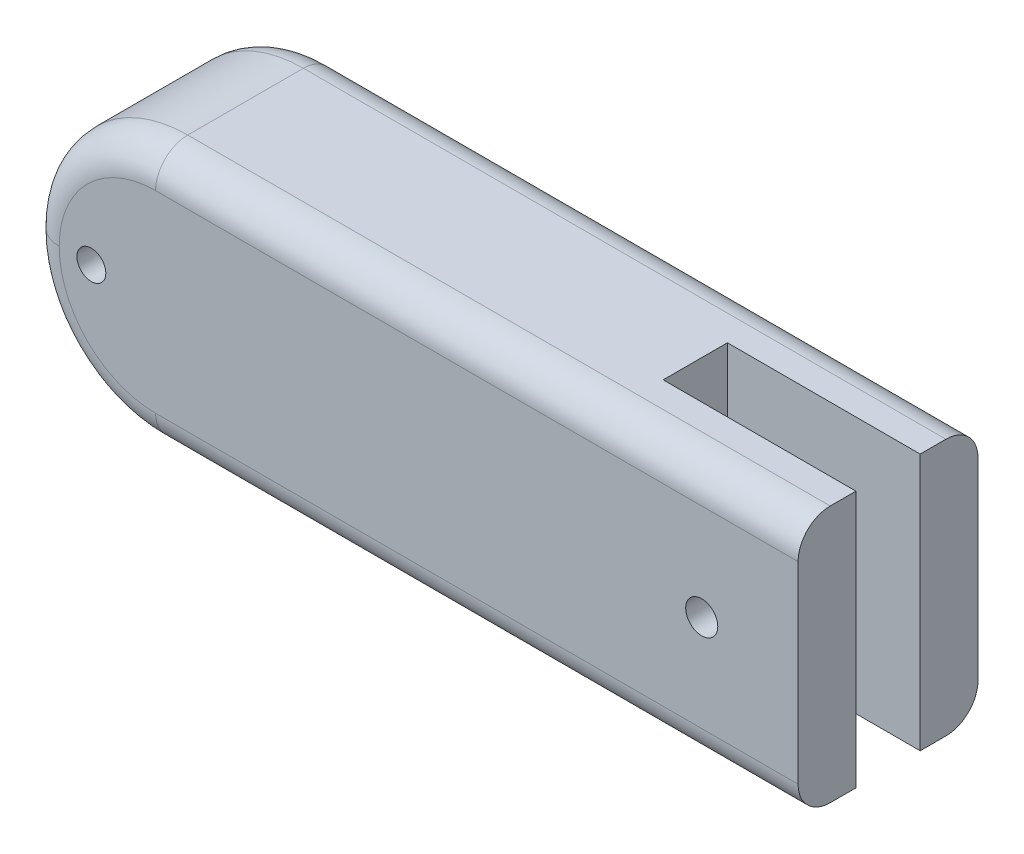
ISO-10303-21;
HEADER;
FILE_DESCRIPTION(('STEP AP214'),'2;1');
FILE_NAME('part.step','',(''),(''),'','','');
FILE_SCHEMA(('AUTOMOTIVE_DESIGN { 1 0 10303 214 1 1 1 1 }'));
ENDSEC;
DATA;
#1=APPLICATION_CONTEXT('core data for automotive mechanical design processes');
#2=APPLICATION_PROTOCOL_DEFINITION('international standard','automotive_design',2000,#1);
#3=PRODUCT_CONTEXT('',#1,'mechanical');
#4=PRODUCT('Part','Part','',(#3));
#5=PRODUCT_RELATED_PRODUCT_CATEGORY('part','',(#4));
#6=PRODUCT_DEFINITION_FORMATION('','',#4);
#7=PRODUCT_DEFINITION_CONTEXT('part definition',#1,'design');
#8=PRODUCT_DEFINITION('design','',#6,#7);
#9=PRODUCT_DEFINITION_SHAPE('','',#8);
#10=(LENGTH_UNIT() NAMED_UNIT(*) SI_UNIT(.MILLI.,.METRE.));
#11=(NAMED_UNIT(*) PLANE_ANGLE_UNIT() SI_UNIT($,.RADIAN.));
#12=(NAMED_UNIT(*) SI_UNIT($,.STERADIAN.) SOLID_ANGLE_UNIT());
#13=UNCERTAINTY_MEASURE_WITH_UNIT(LENGTH_MEASURE(1.E-05),#10,'distance_accuracy_value','');
#14=(GEOMETRIC_REPRESENTATION_CONTEXT(3) GLOBAL_UNCERTAINTY_ASSIGNED_CONTEXT((#13)) GLOBAL_UNIT_ASSIGNED_CONTEXT((#10,
#11,#12)) REPRESENTATION_CONTEXT('',''));
#15=CARTESIAN_POINT('',(0.,0.,0.));
#16=DIRECTION('',(0.,0.,1.));
#17=DIRECTION('',(1.,0.,0.));
#18=AXIS2_PLACEMENT_3D('',#15,#16,#17);
#19=CARTESIAN_POINT('',(120.,0.,28.));
#20=DIRECTION('',(-1.,0.,0.));
#21=DIRECTION('',(0.,0.,1.));
#22=AXIS2_PLACEMENT_3D('',#19,#20,#21);
#23=PLANE('',#22);
#24=DIRECTION('',(0.,0.,-1.));
#25=VECTOR('',#24,1.);
#26=CARTESIAN_POINT('',(120.,0.,28.));
#27=LINE('',#26,#25);
#28=CARTESIAN_POINT('',(120.,0.,9.));
#29=VERTEX_POINT('',#28);
#30=CARTESIAN_POINT('',(120.,0.,5.));
#31=VERTEX_POINT('',#30);
#32=EDGE_CURVE('E182',#29,#31,#27,.T.);
#33=ORIENTED_EDGE('',*,*,#32,.T.);
#34=CARTESIAN_POINT('',(120.,5.,5.));
#35=DIRECTION('',(-1.,0.,0.));
#36=DIRECTION('',(0.,0.,1.));
#37=AXIS2_PLACEMENT_3D('',#34,#35,#36);
#38=CIRCLE('',#37,5.);
#39=CARTESIAN_POINT('',(120.,5.,0.));
#40=VERTEX_POINT('',#39);
#41=EDGE_CURVE('E227',#31,#40,#38,.F.);
#42=ORIENTED_EDGE('',*,*,#41,.T.);
#43=DIRECTION('',(0.,1.,0.));
#44=VECTOR('',#43,1.);
#45=CARTESIAN_POINT('',(120.,0.,0.));
#46=LINE('',#45,#44);
#47=CARTESIAN_POINT('',(120.,35.,0.));
#48=VERTEX_POINT('',#47);
#49=EDGE_CURVE('E171',#40,#48,#46,.T.);
#50=ORIENTED_EDGE('',*,*,#49,.T.);
#51=CARTESIAN_POINT('',(120.,35.,5.));
#52=DIRECTION('',(-1.,0.,0.));
#53=DIRECTION('',(0.,0.,1.));
#54=AXIS2_PLACEMENT_3D('',#51,#52,#53);
#55=CIRCLE('',#54,5.);
#56=CARTESIAN_POINT('',(120.,40.,5.));
#57=VERTEX_POINT('',#56);
#58=EDGE_CURVE('E225',#48,#57,#55,.F.);
#59=ORIENTED_EDGE('',*,*,#58,.T.);
#60=DIRECTION('',(0.,0.,-1.));
#61=VECTOR('',#60,1.);
#62=CARTESIAN_POINT('',(120.,40.,28.));
#63=LINE('',#62,#61);
#64=CARTESIAN_POINT('',(120.,40.,9.));
#65=VERTEX_POINT('',#64);
#66=EDGE_CURVE('E178',#65,#57,#63,.T.);
#67=ORIENTED_EDGE('',*,*,#66,.F.);
#68=DIRECTION('',(0.,1.,0.));
#69=VECTOR('',#68,1.);
#70=CARTESIAN_POINT('',(120.,0.,9.));
#71=LINE('',#70,#69);
#72=EDGE_CURVE('E194',#29,#65,#71,.T.);
#73=ORIENTED_EDGE('',*,*,#72,.F.);
#74=EDGE_LOOP('',(#33,#42,#50,#59,#67,#73));
#75=FACE_BOUND('',#74,.T.);
#76=ADVANCED_FACE('F36',(#75),#23,.F.);
#77=CARTESIAN_POINT('',(0.,0.,28.));
#78=DIRECTION('',(0.,0.,-1.));
#79=DIRECTION('',(-1.,0.,0.));
#80=AXIS2_PLACEMENT_3D('',#77,#78,#79);
#81=PLANE('',#80);
#82=CARTESIAN_POINT('',(105.,20.,28.));
#83=DIRECTION('',(0.,0.,1.));
#84=DIRECTION('',(1.,0.,0.));
#85=AXIS2_PLACEMENT_3D('',#82,#83,#84);
#86=CIRCLE('',#85,2.50000000000001);
#87=CARTESIAN_POINT('',(107.5,20.,28.));
#88=VERTEX_POINT('',#87);
#89=EDGE_CURVE('E317',#88,#88,#86,.T.);
#90=ORIENTED_EDGE('',*,*,#89,.F.);
#91=EDGE_LOOP('',(#90));
#92=FACE_BOUND('',#91,.T.);
#93=DIRECTION('',(0.,1.,0.));
#94=VECTOR('',#93,1.);
#95=CARTESIAN_POINT('',(120.,0.,28.));
#96=LINE('',#95,#94);
#97=CARTESIAN_POINT('',(120.,5.,28.));
#98=VERTEX_POINT('',#97);
#99=CARTESIAN_POINT('',(120.,35.,28.));
#100=VERTEX_POINT('',#99);
#101=EDGE_CURVE('E175',#98,#100,#96,.T.);
#102=ORIENTED_EDGE('',*,*,#101,.T.);
#103=DIRECTION('',(-1.,0.,0.));
#104=VECTOR('',#103,1.);
#105=CARTESIAN_POINT('',(0.,35.,28.));
#106=LINE('',#105,#104);
#107=CARTESIAN_POINT('',(20.,35.,28.));
#108=VERTEX_POINT('',#107);
#109=EDGE_CURVE('E201',#100,#108,#106,.T.);
#110=ORIENTED_EDGE('',*,*,#109,.T.);
#111=CARTESIAN_POINT('',(20.,20.,28.));
#112=DIRECTION('',(0.,0.,-1.));
#113=DIRECTION('',(-1.,0.,0.));
#114=AXIS2_PLACEMENT_3D('',#111,#112,#113);
#115=CIRCLE('',#114,15.);
#116=CARTESIAN_POINT('',(5.,20.,28.));
#117=VERTEX_POINT('',#116);
#118=EDGE_CURVE('E199',#108,#117,#115,.F.);
#119=ORIENTED_EDGE('',*,*,#118,.T.);
#120=CARTESIAN_POINT('',(20.,20.,28.));
#121=DIRECTION('',(0.,0.,-1.));
#122=DIRECTION('',(-1.,0.,0.));
#123=AXIS2_PLACEMENT_3D('',#120,#121,#122);
#124=CIRCLE('',#123,15.);
#125=CARTESIAN_POINT('',(20.,5.,28.));
#126=VERTEX_POINT('',#125);
#127=EDGE_CURVE('E197',#117,#126,#124,.F.);
#128=ORIENTED_EDGE('',*,*,#127,.T.);
#129=DIRECTION('',(1.,0.,0.));
#130=VECTOR('',#129,1.);
#131=CARTESIAN_POINT('',(0.,5.,28.));
#132=LINE('',#131,#130);
#133=EDGE_CURVE('E190',#126,#98,#132,.T.);
#134=ORIENTED_EDGE('',*,*,#133,.T.);
#135=EDGE_LOOP('',(#102,#110,#119,#128,#134));
#136=FACE_BOUND('',#135,.T.);
#137=CARTESIAN_POINT('',(10.,20.,28.));
#138=DIRECTION('',(0.,0.,1.));
#139=DIRECTION('',(1.,0.,0.));
#140=AXIS2_PLACEMENT_3D('',#137,#138,#139);
#141=CIRCLE('',#140,2.25);
#142=CARTESIAN_POINT('',(12.25,20.,28.));
#143=VERTEX_POINT('',#142);
#144=EDGE_CURVE('E168',#143,#143,#141,.T.);
#145=ORIENTED_EDGE('',*,*,#144,.F.);
#146=EDGE_LOOP('',(#145));
#147=FACE_BOUND('',#146,.T.);
#148=ADVANCED_FACE('F337',(#92,#136,#147),#81,.F.);
#149=CARTESIAN_POINT('',(0.,0.,0.));
#150=DIRECTION('',(0.,0.,-1.));
#151=DIRECTION('',(-1.,0.,0.));
#152=AXIS2_PLACEMENT_3D('',#149,#150,#151);
#153=PLANE('',#152);
#154=CARTESIAN_POINT('',(105.,20.,0.));
#155=DIRECTION('',(0.,0.,-1.));
#156=DIRECTION('',(-1.,0.,0.));
#157=AXIS2_PLACEMENT_3D('',#154,#155,#156);
#158=CIRCLE('',#157,2.50000000000001);
#159=CARTESIAN_POINT('',(102.5,20.,0.));
#160=VERTEX_POINT('',#159);
#161=EDGE_CURVE('E246',#160,#160,#158,.T.);
#162=ORIENTED_EDGE('',*,*,#161,.F.);
#163=EDGE_LOOP('',(#162));
#164=FACE_BOUND('',#163,.T.);
#165=ORIENTED_EDGE('',*,*,#49,.F.);
#166=DIRECTION('',(1.,0.,0.));
#167=VECTOR('',#166,1.);
#168=CARTESIAN_POINT('',(20.,5.,0.));
#169=LINE('',#168,#167);
#170=CARTESIAN_POINT('',(20.,5.,0.));
#171=VERTEX_POINT('',#170);
#172=EDGE_CURVE('E11',#40,#171,#169,.F.);
#173=ORIENTED_EDGE('',*,*,#172,.T.);
#174=CARTESIAN_POINT('',(20.,20.,0.));
#175=DIRECTION('',(0.,0.,-1.));
#176=DIRECTION('',(-1.,0.,0.));
#177=AXIS2_PLACEMENT_3D('',#174,#175,#176);
#178=CIRCLE('',#177,15.);
#179=CARTESIAN_POINT('',(5.,20.,0.));
#180=VERTEX_POINT('',#179);
#181=EDGE_CURVE('E45',#171,#180,#178,.T.);
#182=ORIENTED_EDGE('',*,*,#181,.T.);
#183=CARTESIAN_POINT('',(20.,20.,0.));
#184=DIRECTION('',(0.,0.,-1.));
#185=DIRECTION('',(-1.,0.,0.));
#186=AXIS2_PLACEMENT_3D('',#183,#184,#185);
#187=CIRCLE('',#186,15.);
#188=CARTESIAN_POINT('',(20.,35.,0.));
#189=VERTEX_POINT('',#188);
#190=EDGE_CURVE('E231',#180,#189,#187,.T.);
#191=ORIENTED_EDGE('',*,*,#190,.T.);
#192=DIRECTION('',(-1.,0.,0.));
#193=VECTOR('',#192,1.);
#194=CARTESIAN_POINT('',(120.,35.,0.));
#195=LINE('',#194,#193);
#196=EDGE_CURVE('E229',#189,#48,#195,.F.);
#197=ORIENTED_EDGE('',*,*,#196,.T.);
#198=EDGE_LOOP('',(#165,#173,#182,#191,#197));
#199=FACE_BOUND('',#198,.T.);
#200=CARTESIAN_POINT('',(10.,20.,0.));
#201=DIRECTION('',(0.,0.,1.));
#202=DIRECTION('',(1.,0.,0.));
#203=AXIS2_PLACEMENT_3D('',#200,#201,#202);
#204=CIRCLE('',#203,2.25);
#205=CARTESIAN_POINT('',(12.25,20.,0.));
#206=VERTEX_POINT('',#205);
#207=EDGE_CURVE('E172',#206,#206,#204,.T.);
#208=ORIENTED_EDGE('',*,*,#207,.T.);
#209=EDGE_LOOP('',(#208));
#210=FACE_BOUND('',#209,.T.);
#211=ADVANCED_FACE('F258',(#164,#199,#210),#153,.T.);
#212=CARTESIAN_POINT('',(0.,0.,28.));
#213=DIRECTION('',(0.,1.,0.));
#214=DIRECTION('',(0.,0.,1.));
#215=AXIS2_PLACEMENT_3D('',#212,#213,#214);
#216=PLANE('',#215);
#217=DIRECTION('',(0.,0.,-1.));
#218=VECTOR('',#217,1.);
#219=CARTESIAN_POINT('',(20.,0.,28.));
#220=LINE('',#219,#218);
#221=CARTESIAN_POINT('',(20.,0.,23.));
#222=VERTEX_POINT('',#221);
#223=CARTESIAN_POINT('',(20.,0.,5.));
#224=VERTEX_POINT('',#223);
#225=EDGE_CURVE('E185',#222,#224,#220,.T.);
#226=ORIENTED_EDGE('',*,*,#225,.T.);
#227=DIRECTION('',(1.,0.,0.));
#228=VECTOR('',#227,1.);
#229=CARTESIAN_POINT('',(120.,0.,5.));
#230=LINE('',#229,#228);
#231=EDGE_CURVE('E222',#224,#31,#230,.T.);
#232=ORIENTED_EDGE('',*,*,#231,.T.);
#233=ORIENTED_EDGE('',*,*,#32,.F.);
#234=DIRECTION('',(1.,0.,0.));
#235=VECTOR('',#234,1.);
#236=CARTESIAN_POINT('',(90.,0.,9.));
#237=LINE('',#236,#235);
#238=CARTESIAN_POINT('',(90.,0.,9.));
#239=VERTEX_POINT('',#238);
#240=EDGE_CURVE('E163',#239,#29,#237,.T.);
#241=ORIENTED_EDGE('',*,*,#240,.F.);
#242=DIRECTION('',(0.,0.,-1.));
#243=VECTOR('',#242,1.);
#244=CARTESIAN_POINT('',(90.,0.,19.));
#245=LINE('',#244,#243);
#246=CARTESIAN_POINT('',(90.,0.,19.));
#247=VERTEX_POINT('',#246);
#248=EDGE_CURVE('E147',#247,#239,#245,.T.);
#249=ORIENTED_EDGE('',*,*,#248,.F.);
#250=DIRECTION('',(1.,0.,0.));
#251=VECTOR('',#250,1.);
#252=CARTESIAN_POINT('',(90.,0.,19.));
#253=LINE('',#252,#251);
#254=CARTESIAN_POINT('',(120.,0.,19.));
#255=VERTEX_POINT('',#254);
#256=EDGE_CURVE('E143',#247,#255,#253,.T.);
#257=ORIENTED_EDGE('',*,*,#256,.T.);
#258=CARTESIAN_POINT('',(120.,0.,23.));
#259=VERTEX_POINT('',#258);
#260=EDGE_CURVE('E183',#259,#255,#27,.T.);
#261=ORIENTED_EDGE('',*,*,#260,.F.);
#262=DIRECTION('',(1.,0.,0.));
#263=VECTOR('',#262,1.);
#264=CARTESIAN_POINT('',(0.,0.,23.));
#265=LINE('',#264,#263);
#266=EDGE_CURVE('E220',#259,#222,#265,.F.);
#267=ORIENTED_EDGE('',*,*,#266,.T.);
#268=EDGE_LOOP('',(#226,#232,#233,#241,#249,#257,#261,#267));
#269=FACE_BOUND('',#268,.T.);
#270=ADVANCED_FACE('F270',(#269),#216,.F.);
#271=CARTESIAN_POINT('',(120.,40.,23.));
#272=VERTEX_POINT('',#271);
#273=CARTESIAN_POINT('',(120.,40.,19.));
#274=VERTEX_POINT('',#273);
#275=EDGE_CURVE('E160',#272,#274,#63,.T.);
#276=ORIENTED_EDGE('',*,*,#275,.F.);
#277=CARTESIAN_POINT('',(120.,35.,23.));
#278=DIRECTION('',(-1.,0.,0.));
#279=DIRECTION('',(0.,0.,1.));
#280=AXIS2_PLACEMENT_3D('',#277,#278,#279);
#281=CIRCLE('',#280,5.);
#282=EDGE_CURVE('E210',#272,#100,#281,.F.);
#283=ORIENTED_EDGE('',*,*,#282,.T.);
#284=ORIENTED_EDGE('',*,*,#101,.F.);
#285=CARTESIAN_POINT('',(120.,5.,23.));
#286=DIRECTION('',(-1.,0.,0.));
#287=DIRECTION('',(0.,0.,1.));
#288=AXIS2_PLACEMENT_3D('',#285,#286,#287);
#289=CIRCLE('',#288,5.);
#290=EDGE_CURVE('E208',#98,#259,#289,.F.);
#291=ORIENTED_EDGE('',*,*,#290,.T.);
#292=ORIENTED_EDGE('',*,*,#260,.T.);
#293=DIRECTION('',(0.,-1.,0.));
#294=VECTOR('',#293,1.);
#295=CARTESIAN_POINT('',(120.,0.,19.));
#296=LINE('',#295,#294);
#297=EDGE_CURVE('E304',#274,#255,#296,.T.);
#298=ORIENTED_EDGE('',*,*,#297,.F.);
#299=EDGE_LOOP('',(#276,#283,#284,#291,#292,#298));
#300=FACE_BOUND('',#299,.T.);
#301=ADVANCED_FACE('F302',(#300),#23,.F.);
#302=CARTESIAN_POINT('',(0.,40.,28.));
#303=DIRECTION('',(0.,-1.,0.));
#304=DIRECTION('',(0.,0.,-1.));
#305=AXIS2_PLACEMENT_3D('',#302,#303,#304);
#306=PLANE('',#305);
#307=DIRECTION('',(0.,0.,-1.));
#308=VECTOR('',#307,1.);
#309=CARTESIAN_POINT('',(20.,40.,28.));
#310=LINE('',#309,#308);
#311=CARTESIAN_POINT('',(20.,40.,5.));
#312=VERTEX_POINT('',#311);
#313=CARTESIAN_POINT('',(20.,40.,23.));
#314=VERTEX_POINT('',#313);
#315=EDGE_CURVE('E188',#312,#314,#310,.F.);
#316=ORIENTED_EDGE('',*,*,#315,.T.);
#317=DIRECTION('',(-1.,0.,0.));
#318=VECTOR('',#317,1.);
#319=CARTESIAN_POINT('',(0.,40.,23.));
#320=LINE('',#319,#318);
#321=EDGE_CURVE('E206',#314,#272,#320,.F.);
#322=ORIENTED_EDGE('',*,*,#321,.T.);
#323=ORIENTED_EDGE('',*,*,#275,.T.);
#324=DIRECTION('',(1.,0.,0.));
#325=VECTOR('',#324,1.);
#326=CARTESIAN_POINT('',(90.,40.,19.));
#327=LINE('',#326,#325);
#328=CARTESIAN_POINT('',(90.,40.,19.));
#329=VERTEX_POINT('',#328);
#330=EDGE_CURVE('E140',#329,#274,#327,.T.);
#331=ORIENTED_EDGE('',*,*,#330,.F.);
#332=DIRECTION('',(0.,0.,1.));
#333=VECTOR('',#332,1.);
#334=CARTESIAN_POINT('',(90.,40.,19.));
#335=LINE('',#334,#333);
#336=CARTESIAN_POINT('',(90.,40.,9.));
#337=VERTEX_POINT('',#336);
#338=EDGE_CURVE('E148',#337,#329,#335,.T.);
#339=ORIENTED_EDGE('',*,*,#338,.F.);
#340=DIRECTION('',(1.,0.,0.));
#341=VECTOR('',#340,1.);
#342=CARTESIAN_POINT('',(90.,40.,9.));
#343=LINE('',#342,#341);
#344=EDGE_CURVE('E161',#337,#65,#343,.T.);
#345=ORIENTED_EDGE('',*,*,#344,.T.);
#346=ORIENTED_EDGE('',*,*,#66,.T.);
#347=DIRECTION('',(-1.,0.,0.));
#348=VECTOR('',#347,1.);
#349=CARTESIAN_POINT('',(20.,40.,5.));
#350=LINE('',#349,#348);
#351=EDGE_CURVE('E204',#57,#312,#350,.T.);
#352=ORIENTED_EDGE('',*,*,#351,.T.);
#353=EDGE_LOOP('',(#316,#322,#323,#331,#339,#345,#346,#352));
#354=FACE_BOUND('',#353,.T.);
#355=ADVANCED_FACE('F158',(#354),#306,.F.);
#356=CARTESIAN_POINT('',(10.,20.,28.));
#357=DIRECTION('',(0.,0.,-1.));
#358=DIRECTION('',(-1.,0.,0.));
#359=AXIS2_PLACEMENT_3D('',#356,#357,#358);
#360=CYLINDRICAL_SURFACE('',#359,2.25);
#361=ORIENTED_EDGE('',*,*,#144,.T.);
#362=EDGE_LOOP('',(#361));
#363=FACE_BOUND('',#362,.T.);
#364=ORIENTED_EDGE('',*,*,#207,.F.);
#365=EDGE_LOOP('',(#364));
#366=FACE_BOUND('',#365,.T.);
#367=ADVANCED_FACE('F351',(#363,#366),#360,.F.);
#368=CARTESIAN_POINT('',(90.,0.,9.));
#369=DIRECTION('',(0.,0.,-1.));
#370=DIRECTION('',(-1.,0.,0.));
#371=AXIS2_PLACEMENT_3D('',#368,#369,#370);
#372=PLANE('',#371);
#373=CARTESIAN_POINT('',(105.,20.,9.));
#374=DIRECTION('',(0.,0.,-1.));
#375=DIRECTION('',(-1.,0.,0.));
#376=AXIS2_PLACEMENT_3D('',#373,#374,#375);
#377=CIRCLE('',#376,2.50000000000001);
#378=CARTESIAN_POINT('',(102.5,20.,9.));
#379=VERTEX_POINT('',#378);
#380=EDGE_CURVE('E314',#379,#379,#377,.T.);
#381=ORIENTED_EDGE('',*,*,#380,.T.);
#382=EDGE_LOOP('',(#381));
#383=FACE_BOUND('',#382,.T.);
#384=ORIENTED_EDGE('',*,*,#72,.T.);
#385=ORIENTED_EDGE('',*,*,#344,.F.);
#386=DIRECTION('',(0.,1.,0.));
#387=VECTOR('',#386,1.);
#388=CARTESIAN_POINT('',(90.,0.,9.));
#389=LINE('',#388,#387);
#390=EDGE_CURVE('E152',#239,#337,#389,.T.);
#391=ORIENTED_EDGE('',*,*,#390,.F.);
#392=ORIENTED_EDGE('',*,*,#240,.T.);
#393=EDGE_LOOP('',(#384,#385,#391,#392));
#394=FACE_BOUND('',#393,.T.);
#395=ADVANCED_FACE('F310',(#383,#394),#372,.F.);
#396=CARTESIAN_POINT('',(90.,0.,19.));
#397=DIRECTION('',(0.,0.,1.));
#398=DIRECTION('',(1.,0.,0.));
#399=AXIS2_PLACEMENT_3D('',#396,#397,#398);
#400=PLANE('',#399);
#401=CARTESIAN_POINT('',(105.,20.,19.));
#402=DIRECTION('',(0.,0.,1.));
#403=DIRECTION('',(1.,0.,0.));
#404=AXIS2_PLACEMENT_3D('',#401,#402,#403);
#405=CIRCLE('',#404,2.50000000000001);
#406=CARTESIAN_POINT('',(107.5,20.,19.));
#407=VERTEX_POINT('',#406);
#408=EDGE_CURVE('E40',#407,#407,#405,.T.);
#409=ORIENTED_EDGE('',*,*,#408,.T.);
#410=EDGE_LOOP('',(#409));
#411=FACE_BOUND('',#410,.T.);
#412=ORIENTED_EDGE('',*,*,#297,.T.);
#413=ORIENTED_EDGE('',*,*,#256,.F.);
#414=DIRECTION('',(0.,-1.,0.));
#415=VECTOR('',#414,1.);
#416=CARTESIAN_POINT('',(90.,0.,19.));
#417=LINE('',#416,#415);
#418=EDGE_CURVE('E135',#329,#247,#417,.T.);
#419=ORIENTED_EDGE('',*,*,#418,.F.);
#420=ORIENTED_EDGE('',*,*,#330,.T.);
#421=EDGE_LOOP('',(#412,#413,#419,#420));
#422=FACE_BOUND('',#421,.T.);
#423=ADVANCED_FACE('F138',(#411,#422),#400,.F.);
#424=CARTESIAN_POINT('',(90.,0.,0.));
#425=DIRECTION('',(-1.,0.,0.));
#426=DIRECTION('',(0.,0.,1.));
#427=AXIS2_PLACEMENT_3D('',#424,#425,#426);
#428=PLANE('',#427);
#429=ORIENTED_EDGE('',*,*,#390,.T.);
#430=ORIENTED_EDGE('',*,*,#338,.T.);
#431=ORIENTED_EDGE('',*,*,#418,.T.);
#432=ORIENTED_EDGE('',*,*,#248,.T.);
#433=EDGE_LOOP('',(#429,#430,#431,#432));
#434=FACE_BOUND('',#433,.T.);
#435=ADVANCED_FACE('F151',(#434),#428,.F.);
#436=CARTESIAN_POINT('',(20.,20.,28.));
#437=DIRECTION('',(0.,0.,-1.));
#438=DIRECTION('',(-1.,0.,0.));
#439=AXIS2_PLACEMENT_3D('',#436,#437,#438);
#440=CYLINDRICAL_SURFACE('',#439,20.);
#441=DIRECTION('',(0.,0.,-1.));
#442=VECTOR('',#441,1.);
#443=CARTESIAN_POINT('',(0.,20.,28.));
#444=LINE('',#443,#442);
#445=CARTESIAN_POINT('',(0.,20.,23.));
#446=VERTEX_POINT('',#445);
#447=CARTESIAN_POINT('',(0.,20.,5.));
#448=VERTEX_POINT('',#447);
#449=EDGE_CURVE('E191',#446,#448,#444,.T.);
#450=ORIENTED_EDGE('',*,*,#449,.F.);
#451=CARTESIAN_POINT('',(20.,20.,23.));
#452=DIRECTION('',(0.,0.,-1.));
#453=DIRECTION('',(-1.,0.,0.));
#454=AXIS2_PLACEMENT_3D('',#451,#452,#453);
#455=CIRCLE('',#454,20.);
#456=EDGE_CURVE('E214',#446,#314,#455,.T.);
#457=ORIENTED_EDGE('',*,*,#456,.T.);
#458=ORIENTED_EDGE('',*,*,#315,.F.);
#459=CARTESIAN_POINT('',(20.,20.,5.));
#460=DIRECTION('',(0.,0.,-1.));
#461=DIRECTION('',(-1.,0.,0.));
#462=AXIS2_PLACEMENT_3D('',#459,#460,#461);
#463=CIRCLE('',#462,20.);
#464=EDGE_CURVE('E212',#312,#448,#463,.F.);
#465=ORIENTED_EDGE('',*,*,#464,.T.);
#466=EDGE_LOOP('',(#450,#457,#458,#465));
#467=FACE_BOUND('',#466,.T.);
#468=ADVANCED_FACE('F286',(#467),#440,.T.);
#469=CARTESIAN_POINT('',(20.,20.,28.));
#470=DIRECTION('',(0.,0.,-1.));
#471=DIRECTION('',(-1.,0.,0.));
#472=AXIS2_PLACEMENT_3D('',#469,#470,#471);
#473=CYLINDRICAL_SURFACE('',#472,20.);
#474=ORIENTED_EDGE('',*,*,#225,.F.);
#475=CARTESIAN_POINT('',(20.,20.,23.));
#476=DIRECTION('',(0.,0.,-1.));
#477=DIRECTION('',(-1.,0.,0.));
#478=AXIS2_PLACEMENT_3D('',#475,#476,#477);
#479=CIRCLE('',#478,20.);
#480=EDGE_CURVE('E218',#222,#446,#479,.T.);
#481=ORIENTED_EDGE('',*,*,#480,.T.);
#482=ORIENTED_EDGE('',*,*,#449,.T.);
#483=CARTESIAN_POINT('',(20.,20.,5.));
#484=DIRECTION('',(0.,0.,-1.));
#485=DIRECTION('',(-1.,0.,0.));
#486=AXIS2_PLACEMENT_3D('',#483,#484,#485);
#487=CIRCLE('',#486,20.);
#488=EDGE_CURVE('E216',#448,#224,#487,.F.);
#489=ORIENTED_EDGE('',*,*,#488,.T.);
#490=EDGE_LOOP('',(#474,#481,#482,#489));
#491=FACE_BOUND('',#490,.T.);
#492=ADVANCED_FACE('F281',(#491),#473,.T.);
#493=CARTESIAN_POINT('',(0.,5.,23.));
#494=DIRECTION('',(1.,0.,0.));
#495=DIRECTION('',(0.,0.,-1.));
#496=AXIS2_PLACEMENT_3D('',#493,#494,#495);
#497=CYLINDRICAL_SURFACE('',#496,5.);
#498=ORIENTED_EDGE('',*,*,#290,.F.);
#499=ORIENTED_EDGE('',*,*,#133,.F.);
#500=CARTESIAN_POINT('',(20.,5.,23.));
#501=DIRECTION('',(-1.,0.,0.));
#502=DIRECTION('',(0.,0.,1.));
#503=AXIS2_PLACEMENT_3D('',#500,#501,#502);
#504=CIRCLE('',#503,5.);
#505=EDGE_CURVE('E195',#222,#126,#504,.T.);
#506=ORIENTED_EDGE('',*,*,#505,.F.);
#507=ORIENTED_EDGE('',*,*,#266,.F.);
#508=EDGE_LOOP('',(#498,#499,#506,#507));
#509=FACE_BOUND('',#508,.T.);
#510=ADVANCED_FACE('F360',(#509),#497,.T.);
#511=CARTESIAN_POINT('',(20.,20.,23.));
#512=DIRECTION('',(0.,0.,-1.));
#513=DIRECTION('',(-1.,0.,0.));
#514=AXIS2_PLACEMENT_3D('',#511,#512,#513);
#515=TOROIDAL_SURFACE('',#514,15.,5.);
#516=ORIENTED_EDGE('',*,*,#505,.T.);
#517=ORIENTED_EDGE('',*,*,#127,.F.);
#518=CARTESIAN_POINT('',(5.,20.,23.));
#519=DIRECTION('',(0.,1.,0.));
#520=DIRECTION('',(0.,0.,1.));
#521=AXIS2_PLACEMENT_3D('',#518,#519,#520);
#522=CIRCLE('',#521,5.);
#523=EDGE_CURVE('E236',#446,#117,#522,.T.);
#524=ORIENTED_EDGE('',*,*,#523,.F.);
#525=ORIENTED_EDGE('',*,*,#480,.F.);
#526=EDGE_LOOP('',(#516,#517,#524,#525));
#527=FACE_BOUND('',#526,.T.);
#528=ADVANCED_FACE('F291',(#527),#515,.T.);
#529=CARTESIAN_POINT('',(20.,20.,23.));
#530=DIRECTION('',(0.,0.,-1.));
#531=DIRECTION('',(-1.,0.,0.));
#532=AXIS2_PLACEMENT_3D('',#529,#530,#531);
#533=TOROIDAL_SURFACE('',#532,15.,5.);
#534=ORIENTED_EDGE('',*,*,#523,.T.);
#535=ORIENTED_EDGE('',*,*,#118,.F.);
#536=CARTESIAN_POINT('',(20.,35.,23.));
#537=DIRECTION('',(1.,0.,0.));
#538=DIRECTION('',(0.,0.,-1.));
#539=AXIS2_PLACEMENT_3D('',#536,#537,#538);
#540=CIRCLE('',#539,5.);
#541=EDGE_CURVE('E234',#314,#108,#540,.T.);
#542=ORIENTED_EDGE('',*,*,#541,.F.);
#543=ORIENTED_EDGE('',*,*,#456,.F.);
#544=EDGE_LOOP('',(#534,#535,#542,#543));
#545=FACE_BOUND('',#544,.T.);
#546=ADVANCED_FACE('F295',(#545),#533,.T.);
#547=CARTESIAN_POINT('',(0.,35.,23.));
#548=DIRECTION('',(-1.,0.,0.));
#549=DIRECTION('',(0.,0.,1.));
#550=AXIS2_PLACEMENT_3D('',#547,#548,#549);
#551=CYLINDRICAL_SURFACE('',#550,5.);
#552=ORIENTED_EDGE('',*,*,#282,.F.);
#553=ORIENTED_EDGE('',*,*,#321,.F.);
#554=ORIENTED_EDGE('',*,*,#541,.T.);
#555=ORIENTED_EDGE('',*,*,#109,.F.);
#556=EDGE_LOOP('',(#552,#553,#554,#555));
#557=FACE_BOUND('',#556,.T.);
#558=ADVANCED_FACE('F300',(#557),#551,.T.);
#559=CARTESIAN_POINT('',(0.,35.,5.));
#560=DIRECTION('',(1.,0.,0.));
#561=DIRECTION('',(0.,0.,-1.));
#562=AXIS2_PLACEMENT_3D('',#559,#560,#561);
#563=CYLINDRICAL_SURFACE('',#562,5.);
#564=ORIENTED_EDGE('',*,*,#58,.F.);
#565=ORIENTED_EDGE('',*,*,#196,.F.);
#566=CARTESIAN_POINT('',(20.,35.,5.));
#567=DIRECTION('',(-1.,0.,0.));
#568=DIRECTION('',(0.,0.,1.));
#569=AXIS2_PLACEMENT_3D('',#566,#567,#568);
#570=CIRCLE('',#569,5.);
#571=EDGE_CURVE('E237',#312,#189,#570,.T.);
#572=ORIENTED_EDGE('',*,*,#571,.F.);
#573=ORIENTED_EDGE('',*,*,#351,.F.);
#574=EDGE_LOOP('',(#564,#565,#572,#573));
#575=FACE_BOUND('',#574,.T.);
#576=ADVANCED_FACE('F38',(#575),#563,.T.);
#577=CARTESIAN_POINT('',(20.,20.,5.));
#578=DIRECTION('',(0.,0.,-1.));
#579=DIRECTION('',(-1.,0.,0.));
#580=AXIS2_PLACEMENT_3D('',#577,#578,#579);
#581=TOROIDAL_SURFACE('',#580,15.,5.);
#582=ORIENTED_EDGE('',*,*,#571,.T.);
#583=ORIENTED_EDGE('',*,*,#190,.F.);
#584=CARTESIAN_POINT('',(5.,20.,5.));
#585=DIRECTION('',(0.,-1.,0.));
#586=DIRECTION('',(0.,0.,-1.));
#587=AXIS2_PLACEMENT_3D('',#584,#585,#586);
#588=CIRCLE('',#587,5.);
#589=EDGE_CURVE('E245',#448,#180,#588,.T.);
#590=ORIENTED_EDGE('',*,*,#589,.F.);
#591=ORIENTED_EDGE('',*,*,#464,.F.);
#592=EDGE_LOOP('',(#582,#583,#590,#591));
#593=FACE_BOUND('',#592,.T.);
#594=ADVANCED_FACE('F252',(#593),#581,.T.);
#595=CARTESIAN_POINT('',(20.,20.,5.));
#596=DIRECTION('',(0.,0.,-1.));
#597=DIRECTION('',(-1.,0.,0.));
#598=AXIS2_PLACEMENT_3D('',#595,#596,#597);
#599=TOROIDAL_SURFACE('',#598,15.,5.);
#600=ORIENTED_EDGE('',*,*,#589,.T.);
#601=ORIENTED_EDGE('',*,*,#181,.F.);
#602=CARTESIAN_POINT('',(20.,5.,5.));
#603=DIRECTION('',(1.,0.,0.));
#604=DIRECTION('',(0.,0.,-1.));
#605=AXIS2_PLACEMENT_3D('',#602,#603,#604);
#606=CIRCLE('',#605,5.);
#607=EDGE_CURVE('E242',#224,#171,#606,.T.);
#608=ORIENTED_EDGE('',*,*,#607,.F.);
#609=ORIENTED_EDGE('',*,*,#488,.F.);
#610=EDGE_LOOP('',(#600,#601,#608,#609));
#611=FACE_BOUND('',#610,.T.);
#612=ADVANCED_FACE('F280',(#611),#599,.T.);
#613=CARTESIAN_POINT('',(0.,5.,5.));
#614=DIRECTION('',(-1.,0.,0.));
#615=DIRECTION('',(0.,0.,1.));
#616=AXIS2_PLACEMENT_3D('',#613,#614,#615);
#617=CYLINDRICAL_SURFACE('',#616,5.);
#618=ORIENTED_EDGE('',*,*,#607,.T.);
#619=ORIENTED_EDGE('',*,*,#172,.F.);
#620=ORIENTED_EDGE('',*,*,#41,.F.);
#621=ORIENTED_EDGE('',*,*,#231,.F.);
#622=EDGE_LOOP('',(#618,#619,#620,#621));
#623=FACE_BOUND('',#622,.T.);
#624=ADVANCED_FACE('F268',(#623),#617,.T.);
#625=CARTESIAN_POINT('',(105.,20.,-12.));
#626=DIRECTION('',(0.,0.,1.));
#627=DIRECTION('',(1.,0.,0.));
#628=AXIS2_PLACEMENT_3D('',#625,#626,#627);
#629=CYLINDRICAL_SURFACE('',#628,2.50000000000001);
#630=ORIENTED_EDGE('',*,*,#89,.T.);
#631=EDGE_LOOP('',(#630));
#632=FACE_BOUND('',#631,.T.);
#633=ORIENTED_EDGE('',*,*,#408,.F.);
#634=EDGE_LOOP('',(#633));
#635=FACE_BOUND('',#634,.T.);
#636=ADVANCED_FACE('F325',(#632,#635),#629,.F.);
#637=ORIENTED_EDGE('',*,*,#161,.T.);
#638=EDGE_LOOP('',(#637));
#639=FACE_BOUND('',#638,.T.);
#640=ORIENTED_EDGE('',*,*,#380,.F.);
#641=EDGE_LOOP('',(#640));
#642=FACE_BOUND('',#641,.T.);
#643=ADVANCED_FACE('F327',(#639,#642),#629,.F.);
#644=CLOSED_SHELL('',(#76,#148,#211,#270,#301,#355,#367,#395,#423,#435,#468,#492,#510,#528,#546,
#558,#576,#594,#612,#624,#636,#643));
#645=MANIFOLD_SOLID_BREP('B2',#644);
#646=ADVANCED_BREP_SHAPE_REPRESENTATION('',(#18,#645),#14);
#647=SHAPE_DEFINITION_REPRESENTATION(#9,#646);
ENDSEC;
END-ISO-10303-21;
